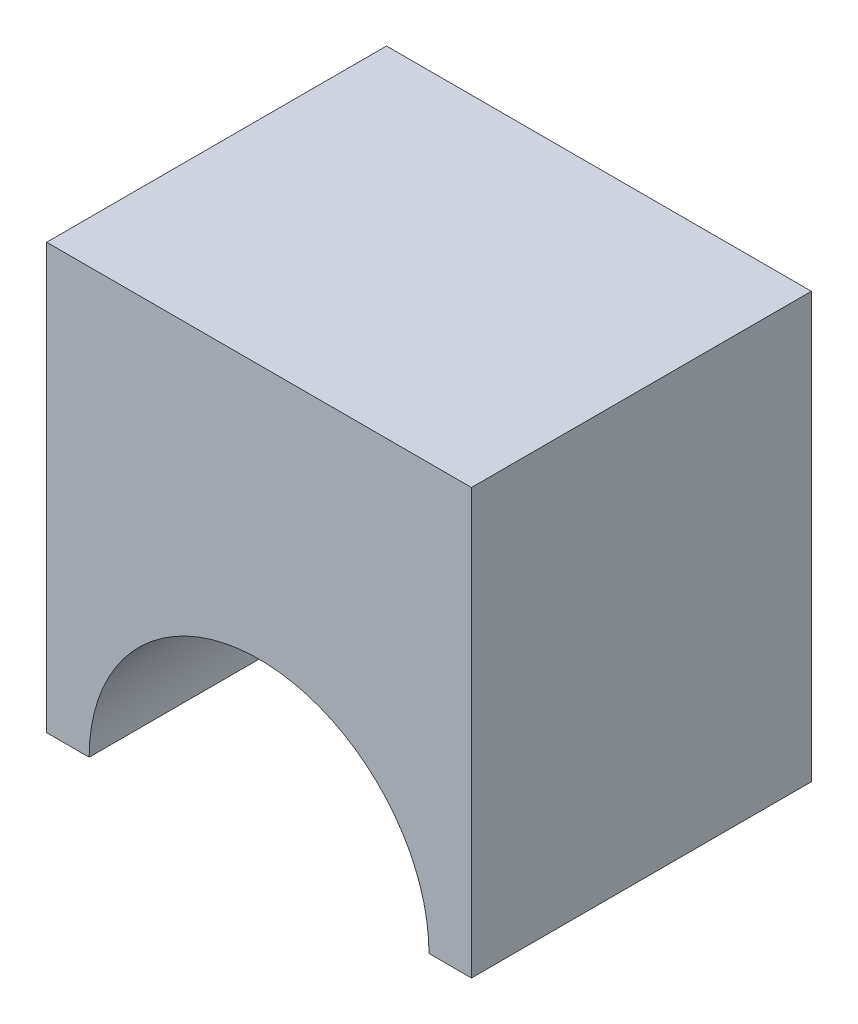
ISO-10303-21;
HEADER;
FILE_DESCRIPTION(('STEP AP214'),'2;1');
FILE_NAME('part.step','',(''),(''),'','','');
FILE_SCHEMA(('AUTOMOTIVE_DESIGN { 1 0 10303 214 1 1 1 1 }'));
ENDSEC;
DATA;
#1=APPLICATION_CONTEXT('core data for automotive mechanical design processes');
#2=APPLICATION_PROTOCOL_DEFINITION('international standard','automotive_design',2000,#1);
#3=PRODUCT_CONTEXT('',#1,'mechanical');
#4=PRODUCT('Part','Part','',(#3));
#5=PRODUCT_RELATED_PRODUCT_CATEGORY('part','',(#4));
#6=PRODUCT_DEFINITION_FORMATION('','',#4);
#7=PRODUCT_DEFINITION_CONTEXT('part definition',#1,'design');
#8=PRODUCT_DEFINITION('design','',#6,#7);
#9=PRODUCT_DEFINITION_SHAPE('','',#8);
#10=(LENGTH_UNIT() NAMED_UNIT(*) SI_UNIT(.MILLI.,.METRE.));
#11=(NAMED_UNIT(*) PLANE_ANGLE_UNIT() SI_UNIT($,.RADIAN.));
#12=(NAMED_UNIT(*) SI_UNIT($,.STERADIAN.) SOLID_ANGLE_UNIT());
#13=UNCERTAINTY_MEASURE_WITH_UNIT(LENGTH_MEASURE(1.E-05),#10,'distance_accuracy_value','');
#14=(GEOMETRIC_REPRESENTATION_CONTEXT(3) GLOBAL_UNCERTAINTY_ASSIGNED_CONTEXT((#13)) GLOBAL_UNIT_ASSIGNED_CONTEXT((#10,
#11,#12)) REPRESENTATION_CONTEXT('',''));
#15=CARTESIAN_POINT('',(0.,0.,0.));
#16=DIRECTION('',(0.,0.,1.));
#17=DIRECTION('',(1.,0.,0.));
#18=AXIS2_PLACEMENT_3D('',#15,#16,#17);
#19=CARTESIAN_POINT('',(0.5,0.,0.));
#20=DIRECTION('',(1.,0.,0.));
#21=DIRECTION('',(0.,1.,0.));
#22=AXIS2_PLACEMENT_3D('',#19,#20,#21);
#23=PLANE('',#22);
#24=DIRECTION('',(0.,0.,-1.));
#25=VECTOR('',#24,1.);
#26=CARTESIAN_POINT('',(0.5,1.,0.));
#27=LINE('',#26,#25);
#28=CARTESIAN_POINT('',(0.5,1.,0.4));
#29=VERTEX_POINT('',#28);
#30=CARTESIAN_POINT('',(0.5,1.,-0.4));
#31=VERTEX_POINT('',#30);
#32=EDGE_CURVE('E11',#29,#31,#27,.T.);
#33=ORIENTED_EDGE('',*,*,#32,.F.);
#34=DIRECTION('',(0.,1.,0.));
#35=VECTOR('',#34,1.);
#36=CARTESIAN_POINT('',(0.5,0.540739649358,0.4));
#37=LINE('',#36,#35);
#38=CARTESIAN_POINT('',(0.5,0.,0.4));
#39=VERTEX_POINT('',#38);
#40=EDGE_CURVE('E99',#39,#29,#37,.T.);
#41=ORIENTED_EDGE('',*,*,#40,.F.);
#42=DIRECTION('',(0.,0.,1.));
#43=VECTOR('',#42,1.);
#44=CARTESIAN_POINT('',(0.5,0.,0.));
#45=LINE('',#44,#43);
#46=CARTESIAN_POINT('',(0.5,0.,-0.4));
#47=VERTEX_POINT('',#46);
#48=EDGE_CURVE('E19',#47,#39,#45,.T.);
#49=ORIENTED_EDGE('',*,*,#48,.F.);
#50=DIRECTION('',(0.,1.,0.));
#51=VECTOR('',#50,1.);
#52=CARTESIAN_POINT('',(0.5,0.540739649358,-0.4));
#53=LINE('',#52,#51);
#54=EDGE_CURVE('E96',#47,#31,#53,.T.);
#55=ORIENTED_EDGE('',*,*,#54,.T.);
#56=EDGE_LOOP('',(#33,#41,#49,#55));
#57=FACE_BOUND('',#56,.T.);
#58=ADVANCED_FACE('F16',(#57),#23,.T.);
#59=CARTESIAN_POINT('',(0.5,1.,0.));
#60=DIRECTION('',(0.,1.,0.));
#61=DIRECTION('',(1.,0.,0.));
#62=AXIS2_PLACEMENT_3D('',#59,#60,#61);
#63=PLANE('',#62);
#64=DIRECTION('',(0.,0.,-1.));
#65=VECTOR('',#64,1.);
#66=CARTESIAN_POINT('',(-0.5,1.,0.));
#67=LINE('',#66,#65);
#68=CARTESIAN_POINT('',(-0.5,1.,0.4));
#69=VERTEX_POINT('',#68);
#70=CARTESIAN_POINT('',(-0.5,1.,-0.4));
#71=VERTEX_POINT('',#70);
#72=EDGE_CURVE('E26',#69,#71,#67,.T.);
#73=ORIENTED_EDGE('',*,*,#72,.F.);
#74=DIRECTION('',(-1.,0.,0.));
#75=VECTOR('',#74,1.);
#76=CARTESIAN_POINT('',(0.,1.,0.4));
#77=LINE('',#76,#75);
#78=EDGE_CURVE('E126',#29,#69,#77,.T.);
#79=ORIENTED_EDGE('',*,*,#78,.F.);
#80=ORIENTED_EDGE('',*,*,#32,.T.);
#81=DIRECTION('',(-1.,0.,0.));
#82=VECTOR('',#81,1.);
#83=CARTESIAN_POINT('',(0.,1.,-0.4));
#84=LINE('',#83,#82);
#85=EDGE_CURVE('E108',#31,#71,#84,.T.);
#86=ORIENTED_EDGE('',*,*,#85,.T.);
#87=EDGE_LOOP('',(#73,#79,#80,#86));
#88=FACE_BOUND('',#87,.T.);
#89=ADVANCED_FACE('F176',(#88),#63,.T.);
#90=CARTESIAN_POINT('',(-0.5,1.,0.));
#91=DIRECTION('',(-1.,0.,0.));
#92=DIRECTION('',(0.,1.,0.));
#93=AXIS2_PLACEMENT_3D('',#90,#91,#92);
#94=PLANE('',#93);
#95=DIRECTION('',(0.,0.,-1.));
#96=VECTOR('',#95,1.);
#97=CARTESIAN_POINT('',(-0.5,0.,0.));
#98=LINE('',#97,#96);
#99=CARTESIAN_POINT('',(-0.5,0.,0.4));
#100=VERTEX_POINT('',#99);
#101=CARTESIAN_POINT('',(-0.5,0.,-0.4));
#102=VERTEX_POINT('',#101);
#103=EDGE_CURVE('E65',#100,#102,#98,.T.);
#104=ORIENTED_EDGE('',*,*,#103,.F.);
#105=DIRECTION('',(0.,-1.,0.));
#106=VECTOR('',#105,1.);
#107=CARTESIAN_POINT('',(-0.5,0.540739649358,0.4));
#108=LINE('',#107,#106);
#109=EDGE_CURVE('E128',#69,#100,#108,.T.);
#110=ORIENTED_EDGE('',*,*,#109,.F.);
#111=ORIENTED_EDGE('',*,*,#72,.T.);
#112=DIRECTION('',(0.,-1.,0.));
#113=VECTOR('',#112,1.);
#114=CARTESIAN_POINT('',(-0.5,0.540739649358,-0.4));
#115=LINE('',#114,#113);
#116=EDGE_CURVE('E90',#71,#102,#115,.T.);
#117=ORIENTED_EDGE('',*,*,#116,.T.);
#118=EDGE_LOOP('',(#104,#110,#111,#117));
#119=FACE_BOUND('',#118,.T.);
#120=ADVANCED_FACE('F175',(#119),#94,.T.);
#121=CARTESIAN_POINT('',(0.4,0.,0.));
#122=DIRECTION('',(0.,-1.,0.));
#123=DIRECTION('',(0.,0.,-1.));
#124=AXIS2_PLACEMENT_3D('',#121,#122,#123);
#125=PLANE('',#124);
#126=ORIENTED_EDGE('',*,*,#48,.T.);
#127=DIRECTION('',(1.,0.,0.));
#128=VECTOR('',#127,1.);
#129=CARTESIAN_POINT('',(0.,0.,0.4));
#130=LINE('',#129,#128);
#131=CARTESIAN_POINT('',(0.4,0.,0.4));
#132=VERTEX_POINT('',#131);
#133=EDGE_CURVE('E133',#132,#39,#130,.T.);
#134=ORIENTED_EDGE('',*,*,#133,.F.);
#135=DIRECTION('',(0.,0.,-1.));
#136=VECTOR('',#135,1.);
#137=CARTESIAN_POINT('',(0.4,0.,0.));
#138=LINE('',#137,#136);
#139=CARTESIAN_POINT('',(0.4,0.,-0.4));
#140=VERTEX_POINT('',#139);
#141=EDGE_CURVE('E113',#132,#140,#138,.T.);
#142=ORIENTED_EDGE('',*,*,#141,.T.);
#143=DIRECTION('',(1.,0.,0.));
#144=VECTOR('',#143,1.);
#145=CARTESIAN_POINT('',(0.,0.,-0.4));
#146=LINE('',#145,#144);
#147=EDGE_CURVE('E106',#140,#47,#146,.T.);
#148=ORIENTED_EDGE('',*,*,#147,.T.);
#149=EDGE_LOOP('',(#126,#134,#142,#148));
#150=FACE_BOUND('',#149,.T.);
#151=ADVANCED_FACE('F111',(#150),#125,.T.);
#152=CARTESIAN_POINT('',(0.,0.540739649358,-0.4));
#153=DIRECTION('',(0.,0.,1.));
#154=DIRECTION('',(1.,0.,0.));
#155=AXIS2_PLACEMENT_3D('',#152,#153,#154);
#156=PLANE('',#155);
#157=ORIENTED_EDGE('',*,*,#147,.F.);
#158=CARTESIAN_POINT('',(0.,0.,-0.4));
#159=DIRECTION('',(0.,0.,1.));
#160=DIRECTION('',(1.,0.,0.));
#161=AXIS2_PLACEMENT_3D('',#158,#159,#160);
#162=CIRCLE('',#161,0.4);
#163=CARTESIAN_POINT('',(-0.4,0.,-0.4));
#164=VERTEX_POINT('',#163);
#165=EDGE_CURVE('E153',#140,#164,#162,.T.);
#166=ORIENTED_EDGE('',*,*,#165,.T.);
#167=DIRECTION('',(1.,0.,0.));
#168=VECTOR('',#167,1.);
#169=CARTESIAN_POINT('',(-0.5,0.,-0.4));
#170=LINE('',#169,#168);
#171=EDGE_CURVE('E116',#102,#164,#170,.T.);
#172=ORIENTED_EDGE('',*,*,#171,.F.);
#173=ORIENTED_EDGE('',*,*,#116,.F.);
#174=ORIENTED_EDGE('',*,*,#85,.F.);
#175=ORIENTED_EDGE('',*,*,#54,.F.);
#176=EDGE_LOOP('',(#157,#166,#172,#173,#174,#175));
#177=FACE_BOUND('',#176,.T.);
#178=ADVANCED_FACE('F104',(#177),#156,.F.);
#179=CARTESIAN_POINT('',(-0.5,0.,0.));
#180=DIRECTION('',(0.,-1.,0.));
#181=DIRECTION('',(0.,0.,-1.));
#182=AXIS2_PLACEMENT_3D('',#179,#180,#181);
#183=PLANE('',#182);
#184=DIRECTION('',(0.,0.,1.));
#185=VECTOR('',#184,1.);
#186=CARTESIAN_POINT('',(-0.4,0.,0.));
#187=LINE('',#186,#185);
#188=CARTESIAN_POINT('',(-0.4,0.,0.4));
#189=VERTEX_POINT('',#188);
#190=EDGE_CURVE('E149',#164,#189,#187,.T.);
#191=ORIENTED_EDGE('',*,*,#190,.T.);
#192=DIRECTION('',(1.,0.,0.));
#193=VECTOR('',#192,1.);
#194=CARTESIAN_POINT('',(0.,0.,0.4));
#195=LINE('',#194,#193);
#196=EDGE_CURVE('E138',#100,#189,#195,.T.);
#197=ORIENTED_EDGE('',*,*,#196,.F.);
#198=ORIENTED_EDGE('',*,*,#103,.T.);
#199=ORIENTED_EDGE('',*,*,#171,.T.);
#200=EDGE_LOOP('',(#191,#197,#198,#199));
#201=FACE_BOUND('',#200,.T.);
#202=ADVANCED_FACE('F173',(#201),#183,.T.);
#203=CARTESIAN_POINT('',(0.,0.540739649358,0.4));
#204=DIRECTION('',(0.,0.,1.));
#205=DIRECTION('',(1.,0.,0.));
#206=AXIS2_PLACEMENT_3D('',#203,#204,#205);
#207=PLANE('',#206);
#208=ORIENTED_EDGE('',*,*,#196,.T.);
#209=CARTESIAN_POINT('',(0.,0.,0.4));
#210=DIRECTION('',(0.,0.,-1.));
#211=DIRECTION('',(1.,0.,0.));
#212=AXIS2_PLACEMENT_3D('',#209,#210,#211);
#213=CIRCLE('',#212,0.4);
#214=EDGE_CURVE('E144',#189,#132,#213,.T.);
#215=ORIENTED_EDGE('',*,*,#214,.T.);
#216=ORIENTED_EDGE('',*,*,#133,.T.);
#217=ORIENTED_EDGE('',*,*,#40,.T.);
#218=ORIENTED_EDGE('',*,*,#78,.T.);
#219=ORIENTED_EDGE('',*,*,#109,.T.);
#220=EDGE_LOOP('',(#208,#215,#216,#217,#218,#219));
#221=FACE_BOUND('',#220,.T.);
#222=ADVANCED_FACE('F174',(#221),#207,.T.);
#223=CARTESIAN_POINT('',(0.,0.,0.));
#224=DIRECTION('',(0.,0.,1.));
#225=DIRECTION('',(1.,0.,0.));
#226=AXIS2_PLACEMENT_3D('',#223,#224,#225);
#227=CYLINDRICAL_SURFACE('',#226,0.4);
#228=ORIENTED_EDGE('',*,*,#190,.F.);
#229=ORIENTED_EDGE('',*,*,#165,.F.);
#230=ORIENTED_EDGE('',*,*,#141,.F.);
#231=ORIENTED_EDGE('',*,*,#214,.F.);
#232=EDGE_LOOP('',(#228,#229,#230,#231));
#233=FACE_BOUND('',#232,.T.);
#234=ADVANCED_FACE('F170',(#233),#227,.F.);
#235=CLOSED_SHELL('',(#58,#89,#120,#151,#178,#202,#222,#234));
#236=MANIFOLD_SOLID_BREP('B1',#235);
#237=ADVANCED_BREP_SHAPE_REPRESENTATION('',(#18,#236),#14);
#238=SHAPE_DEFINITION_REPRESENTATION(#9,#237);
ENDSEC;
END-ISO-10303-21;
